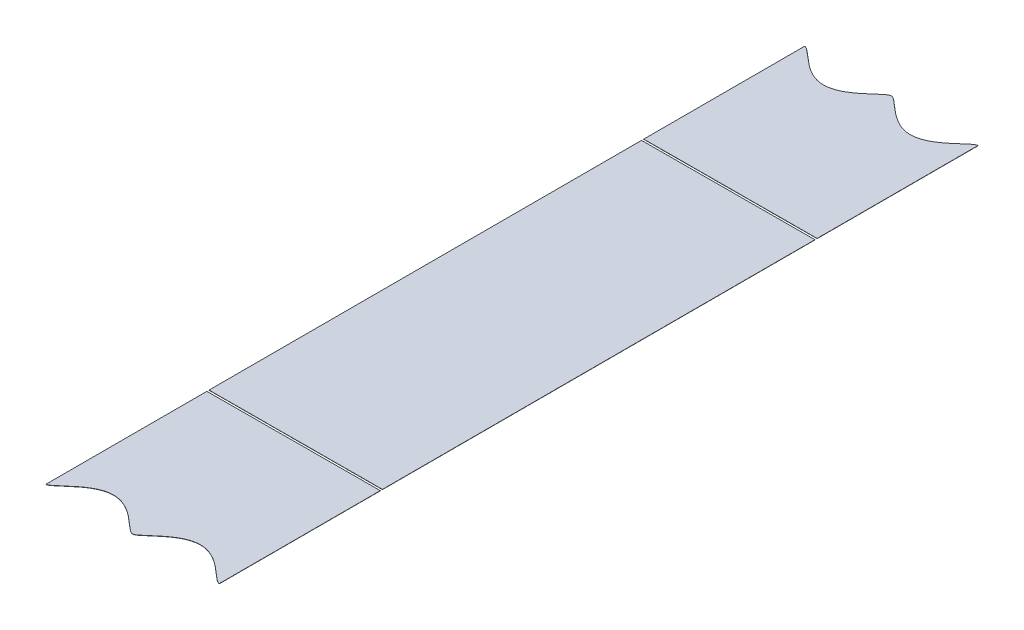
ISO-10303-21;
HEADER;
FILE_DESCRIPTION(('STEP AP214'),'2;1');
FILE_NAME('part.step','',(''),(''),'','','');
FILE_SCHEMA(('AUTOMOTIVE_DESIGN { 1 0 10303 214 1 1 1 1 }'));
ENDSEC;
DATA;
#1=APPLICATION_CONTEXT('core data for automotive mechanical design processes');
#2=APPLICATION_PROTOCOL_DEFINITION('international standard','automotive_design',2000,#1);
#3=PRODUCT_CONTEXT('',#1,'mechanical');
#4=PRODUCT('Part','Part','',(#3));
#5=PRODUCT_RELATED_PRODUCT_CATEGORY('part','',(#4));
#6=PRODUCT_DEFINITION_FORMATION('','',#4);
#7=PRODUCT_DEFINITION_CONTEXT('part definition',#1,'design');
#8=PRODUCT_DEFINITION('design','',#6,#7);
#9=PRODUCT_DEFINITION_SHAPE('','',#8);
#10=(LENGTH_UNIT() NAMED_UNIT(*) SI_UNIT(.MILLI.,.METRE.));
#11=(NAMED_UNIT(*) PLANE_ANGLE_UNIT() SI_UNIT($,.RADIAN.));
#12=(NAMED_UNIT(*) SI_UNIT($,.STERADIAN.) SOLID_ANGLE_UNIT());
#13=UNCERTAINTY_MEASURE_WITH_UNIT(LENGTH_MEASURE(1.E-05),#10,'distance_accuracy_value','');
#14=(GEOMETRIC_REPRESENTATION_CONTEXT(3) GLOBAL_UNCERTAINTY_ASSIGNED_CONTEXT((#13)) GLOBAL_UNIT_ASSIGNED_CONTEXT((#10,
#11,#12)) REPRESENTATION_CONTEXT('',''));
#15=CARTESIAN_POINT('',(0.,0.,0.));
#16=DIRECTION('',(0.,0.,1.));
#17=DIRECTION('',(1.,0.,0.));
#18=AXIS2_PLACEMENT_3D('',#15,#16,#17);
#19=CARTESIAN_POINT('',(-874.689831525036,342.352608319311,3690.50629715667));
#20=DIRECTION('',(0.00396825396824471,-0.999992126449225,0.));
#21=DIRECTION('',(0.999992126449225,0.00396825396824471,0.));
#22=AXIS2_PLACEMENT_3D('',#19,#20,#21);
#23=PLANE('',#22);
#24=DIRECTION('',(0.999992126449225,0.0039682539682445,0.));
#25=VECTOR('',#24,1.);
#26=CARTESIAN_POINT('',(2640.0503968254,356.300099994095,-100.));
#27=LINE('',#26,#25);
#28=CARTESIAN_POINT('',(2640.0503968254,356.300099994095,-100.));
#29=VERTEX_POINT('',#28);
#30=CARTESIAN_POINT('',(2719.43166885493,356.615107522058,-100.));
#31=VERTEX_POINT('',#30);
#32=EDGE_CURVE('E14',#29,#31,#27,.T.);
#33=ORIENTED_EDGE('',*,*,#32,.F.);
#34=DIRECTION('',(0.,0.,1.));
#35=VECTOR('',#34,1.);
#36=CARTESIAN_POINT('',(2640.0503968254,356.300099994095,-173.652216912017));
#37=LINE('',#36,#35);
#38=CARTESIAN_POINT('',(2640.0503968254,356.300099994095,-173.652216912019));
#39=VERTEX_POINT('',#38);
#40=EDGE_CURVE('E109',#39,#29,#37,.T.);
#41=ORIENTED_EDGE('',*,*,#40,.F.);
#42=CARTESIAN_POINT('',(2719.43166885493,356.615107522058,-173.652216912019));
#43=CARTESIAN_POINT('',(2719.25336327566,356.614399954664,-173.646625466255));
#44=CARTESIAN_POINT('',(2718.90207666095,356.613005949186,-173.559155637961));
#45=CARTESIAN_POINT('',(2718.43359748682,356.611146890207,-173.359222557986));
#46=CARTESIAN_POINT('',(2717.81798377242,356.608703959407,-172.958303623836));
#47=CARTESIAN_POINT('',(2717.23650187237,356.606396473382,-172.512932866644));
#48=CARTESIAN_POINT('',(2716.92336939028,356.605153874383,-172.25423628575));
#49=CARTESIAN_POINT('',(2716.49878369486,356.603468997247,-171.903461856444));
#50=CARTESIAN_POINT('',(2715.82331129543,356.600788530112,-171.313780667747));
#51=CARTESIAN_POINT('',(2715.62461925183,356.600000063414,-171.140324342141));
#52=CARTESIAN_POINT('',(2714.86651347999,356.59699168349,-170.474628822936));
#53=CARTESIAN_POINT('',(2714.74003292812,356.596489772586,-170.36379777106));
#54=CARTESIAN_POINT('',(2714.11511295219,356.594009911886,-169.816199446652));
#55=CARTESIAN_POINT('',(2713.65247367997,356.592174027304,-169.419143192877));
#56=CARTESIAN_POINT('',(2713.06635338962,356.589848134823,-168.916110396653));
#57=CARTESIAN_POINT('',(2712.54648640413,356.587785154351,-168.486605911843));
#58=CARTESIAN_POINT('',(2711.33413988219,356.582974217576,-167.484987646326));
#59=CARTESIAN_POINT('',(2710.25972872082,356.578710647652,-166.700784115182));
#60=CARTESIAN_POINT('',(2709.01244281554,356.573761061438,-165.790400784825));
#61=CARTESIAN_POINT('',(2707.84953556888,356.569146313807,-165.096938783266));
#62=CARTESIAN_POINT('',(2706.52889617694,356.563905640037,-164.309418335097));
#63=CARTESIAN_POINT('',(2705.26728183354,356.558899194493,-163.771345912409));
#64=CARTESIAN_POINT('',(2703.86588156271,356.553338038522,-163.173655466969));
#65=CARTESIAN_POINT('',(2701.05071637291,356.542166660128,-162.543732035845));
#66=CARTESIAN_POINT('',(2698.17465183204,356.530753615739,-162.543467999676));
#67=CARTESIAN_POINT('',(2695.35854398808,356.519578496624,-163.17304343693));
#68=CARTESIAN_POINT('',(2693.95591996837,356.514012484468,-163.771217133109));
#69=CARTESIAN_POINT('',(2692.69648697398,356.50901469514,-164.30832449671));
#70=CARTESIAN_POINT('',(2691.37808318925,356.503782892897,-165.094125503448));
#71=CARTESIAN_POINT('',(2690.21341726245,356.499161166321,-165.788294974438));
#72=CARTESIAN_POINT('',(2688.96398092241,356.494203046569,-166.700193067622));
#73=CARTESIAN_POINT('',(2687.89232926098,356.489950427128,-167.482335442792));
#74=CARTESIAN_POINT('',(2686.68353618388,356.485153591435,-168.480722104019));
#75=CARTESIAN_POINT('',(2686.16178178844,356.483083121183,-168.911658249093));
#76=CARTESIAN_POINT('',(2685.57330949206,356.480747895271,-169.416668701426));
#77=CARTESIAN_POINT('',(2685.11012917903,356.478909863684,-169.8141570808));
#78=CARTESIAN_POINT('',(2684.48467716416,356.476427891702,-170.362211520537));
#79=CARTESIAN_POINT('',(2684.35622944635,356.475918174523,-170.474764266942));
#80=CARTESIAN_POINT('',(2683.6012876088,356.472922349992,-171.137685809265));
#81=CARTESIAN_POINT('',(2683.40337901544,356.472136992248,-171.310471497709));
#82=CARTESIAN_POINT('',(2682.73157177862,356.469471069524,-171.896998206569));
#83=CARTESIAN_POINT('',(2682.30876813853,356.467793264091,-172.246601216163));
#84=CARTESIAN_POINT('',(2681.99827251613,356.466561128904,-172.503340264186));
#85=CARTESIAN_POINT('',(2681.41796337893,356.464258296736,-172.948918646703));
#86=CARTESIAN_POINT('',(2681.15134565763,356.463200281575,-173.123420981755));
#87=CARTESIAN_POINT('',(2680.79870151334,356.461800889032,-173.35422794507));
#88=CARTESIAN_POINT('',(2680.32703989949,356.459929201224,-173.557093339146));
#89=CARTESIAN_POINT('',(2679.97435392887,356.458529642702,-173.645974045404));
#90=CARTESIAN_POINT('',(2679.61413987556,356.457100210601,-173.658266805285));
#91=CARTESIAN_POINT('',(2679.25782551004,356.455686253574,-173.590254462723));
#92=CARTESIAN_POINT('',(2678.7814026428,356.453795671754,-173.408008229969));
#93=CARTESIAN_POINT('',(2678.15784559128,356.451321219528,-173.016019024524));
#94=CARTESIAN_POINT('',(2677.57062511323,356.448990961188,-172.572788154957));
#95=CARTESIAN_POINT('',(2677.25640774166,356.447744057039,-172.315051537981));
#96=CARTESIAN_POINT('',(2676.82714675771,356.446040627024,-171.962950464614));
#97=CARTESIAN_POINT('',(2676.15205769789,356.44336168109,-171.374479739641));
#98=CARTESIAN_POINT('',(2675.94296920409,356.442531958312,-171.192218664992));
#99=CARTESIAN_POINT('',(2675.60681877818,356.441198017548,-170.897112934053));
#100=CARTESIAN_POINT('',(2675.08593218089,356.439130990966,-170.439827718325));
#101=CARTESIAN_POINT('',(2675.06174809659,356.439035021622,-170.418623837761));
#102=CARTESIAN_POINT('',(2674.42349522226,356.436502252179,-169.859022839416));
#103=CARTESIAN_POINT('',(2673.96340352107,356.434676477085,-169.463600384942));
#104=CARTESIAN_POINT('',(2673.37331912765,356.432334853912,-168.956456659908));
#105=CARTESIAN_POINT('',(2672.85215201822,356.430266714178,-168.52505968445));
#106=CARTESIAN_POINT('',(2671.64203818338,356.425464637342,-167.523385866472));
#107=CARTESIAN_POINT('',(2670.57136706357,356.421215908969,-166.739150975074));
#108=CARTESIAN_POINT('',(2669.31849075808,356.416244138453,-165.821456180484));
#109=CARTESIAN_POINT('',(2668.15153565928,356.41161332779,-165.122537364466));
#110=CARTESIAN_POINT('',(2666.82938751404,356.406366666857,-164.330669522056));
#111=CARTESIAN_POINT('',(2665.56686320734,356.40135661032,-163.788639955249));
#112=CARTESIAN_POINT('',(2664.16795144573,356.395805329462,-163.18805624203));
#113=CARTESIAN_POINT('',(2661.35962227825,356.384661078354,-162.549920673153));
#114=CARTESIAN_POINT('',(2658.4845757787,356.373252073844,-162.537485124093));
#115=CARTESIAN_POINT('',(2655.66129286038,356.362048481988,-163.15841757952));
#116=CARTESIAN_POINT('',(2654.25472202303,356.356466807733,-163.754368461799));
#117=CARTESIAN_POINT('',(2652.98706519882,356.351436383903,-164.29146277853));
#118=CARTESIAN_POINT('',(2651.66002927199,356.346170326858,-165.080563690001));
#119=CARTESIAN_POINT('',(2650.4944291399,356.34154489309,-165.773669361108));
#120=CARTESIAN_POINT('',(2649.24433816958,356.336584175578,-166.684737604181));
#121=CARTESIAN_POINT('',(2648.16918346286,356.332317655054,-167.468312026312));
#122=CARTESIAN_POINT('',(2646.95680662685,356.327506597983,-168.469075959413));
#123=CARTESIAN_POINT('',(2646.43798629125,356.325447770917,-168.897339403747));
#124=CARTESIAN_POINT('',(2645.85404413414,356.32313052189,-169.398164427017));
#125=CARTESIAN_POINT('',(2645.38778806165,356.321280284812,-169.798054562563));
#126=CARTESIAN_POINT('',(2644.76224529839,356.318797952715,-170.346087909561));
#127=CARTESIAN_POINT('',(2644.62080596261,356.31823668109,-170.470001856191));
#128=CARTESIAN_POINT('',(2643.86605824614,356.315241626887,-171.132773576622));
#129=CARTESIAN_POINT('',(2643.66800970221,356.314455713779,-171.305700111455));
#130=CARTESIAN_POINT('',(2642.98670531965,356.311752103673,-171.900582576675));
#131=CARTESIAN_POINT('',(2642.56017708301,356.310059517978,-172.253012829818));
#132=CARTESIAN_POINT('',(2642.2466477609,356.308815344206,-172.51207473679));
#133=CARTESIAN_POINT('',(2641.6640271652,356.306503339511,-172.958380970878));
#134=CARTESIAN_POINT('',(2641.04766174761,356.304057425739,-173.359693013486));
#135=CARTESIAN_POINT('',(2640.57956567511,356.302199887016,-173.559257747345));
#136=CARTESIAN_POINT('',(2640.22871871028,356.300807626194,-173.64662505233));
#137=CARTESIAN_POINT('',(2640.0503968254,356.300099994095,-173.652216912019));
#138=B_SPLINE_CURVE_WITH_KNOTS('',2,(#42,#43,#44,#45,#46,#47,#48,#49,#50,#51,#52,#53,#54,#55,
#56,#57,#58,#59,#60,#61,#62,#63,#64,#65,#66,#67,#68,#69,#70,#71,#72,#73,#74,#75,#76,#77,#78,#79,
#80,#81,#82,#83,#84,#85,#86,#87,#88,#89,#90,#91,#92,#93,#94,#95,#96,#97,#98,#99,#100,#101,#102,
#103,#104,#105,#106,#107,#108,#109,#110,#111,#112,#113,#114,#115,#116,#117,#118,#119,#120,#121,
#122,#123,#124,#125,#126,#127,#128,#129,#130,#131,#132,#133,#134,#135,#136,#137),.UNSPECIFIED.,
.F.,.F.,(3,1,1,1,1,2,2,1,2,2,2,2,2,2,1,1,1,2,2,2,2,2,2,1,2,2,1,2,1,1,1,1,1,1,1,2,2,2,2,2,2,2,2,
2,1,1,1,2,2,2,2,2,2,1,2,2,1,1,1,1,3),(0.,0.00390625,0.0078125,0.015625,0.0234375,0.03125,
0.046875,0.0546875,0.0625,0.078125,0.09375,0.125,0.15625,0.1875,0.21875,0.25,0.28125,0.3125,
0.34375,0.375,0.40625,0.421875,0.4375,0.4453125,0.453125,0.46875,0.4765625,0.484375,0.4921875,
0.49609375,0.5,0.50390625,0.5078125,0.515625,0.5234375,0.53125,0.546875,0.5546875,0.5625,
0.578125,0.59375,0.625,0.65625,0.6875,0.71875,0.75,0.78125,0.8125,0.84375,0.875,0.90625,
0.921875,0.9375,0.9453125,0.953125,0.96875,0.9765625,0.984375,0.9921875,0.99609375,1.),.UNSPECIFIED.);
#139=CARTESIAN_POINT('',(2719.43166885493,356.615107522058,-173.652216912019));
#140=VERTEX_POINT('',#139);
#141=EDGE_CURVE('E105',#140,#39,#138,.T.);
#142=ORIENTED_EDGE('',*,*,#141,.F.);
#143=DIRECTION('',(0.,0.,1.));
#144=VECTOR('',#143,1.);
#145=CARTESIAN_POINT('',(2719.43166885493,356.615107522058,-173.652216912017));
#146=LINE('',#145,#144);
#147=EDGE_CURVE('E98',#140,#31,#146,.T.);
#148=ORIENTED_EDGE('',*,*,#147,.T.);
#149=EDGE_LOOP('',(#33,#41,#142,#148));
#150=FACE_BOUND('',#149,.T.);
#151=ADVANCED_FACE('F52',(#150),#23,.T.);
#152=CARTESIAN_POINT('',(-874.690228350433,342.452607531956,3690.50629715667));
#153=DIRECTION('',(0.00396825396824471,-0.999992126449225,0.));
#154=DIRECTION('',(0.999992126449225,0.00396825396824471,0.));
#155=AXIS2_PLACEMENT_3D('',#152,#153,#154);
#156=PLANE('',#155);
#157=DIRECTION('',(0.,0.,1.));
#158=VECTOR('',#157,1.);
#159=CARTESIAN_POINT('',(2640.05,356.40009920674,-173.652216912017));
#160=LINE('',#159,#158);
#161=CARTESIAN_POINT('',(2640.05,356.40009920674,-173.652216912019));
#162=VERTEX_POINT('',#161);
#163=CARTESIAN_POINT('',(2640.05,356.40009920674,-100.));
#164=VERTEX_POINT('',#163);
#165=EDGE_CURVE('E55',#162,#164,#160,.T.);
#166=ORIENTED_EDGE('',*,*,#165,.T.);
#167=DIRECTION('',(0.999992126449225,0.00396825396824471,0.));
#168=VECTOR('',#167,1.);
#169=CARTESIAN_POINT('',(-874.690228350433,342.452607531955,-100.));
#170=LINE('',#169,#168);
#171=CARTESIAN_POINT('',(2719.43127202954,356.715106734703,-100.));
#172=VERTEX_POINT('',#171);
#173=EDGE_CURVE('E70',#164,#172,#170,.T.);
#174=ORIENTED_EDGE('',*,*,#173,.T.);
#175=DIRECTION('',(0.,0.,1.));
#176=VECTOR('',#175,1.);
#177=CARTESIAN_POINT('',(2719.43127202953,356.715106734703,-173.652216912017));
#178=LINE('',#177,#176);
#179=CARTESIAN_POINT('',(2719.43127202953,356.715106734703,-173.652216912019));
#180=VERTEX_POINT('',#179);
#181=EDGE_CURVE('E101',#180,#172,#178,.T.);
#182=ORIENTED_EDGE('',*,*,#181,.F.);
#183=CARTESIAN_POINT('',(2719.43127202954,356.715106734703,-173.652216912019));
#184=CARTESIAN_POINT('',(2719.25296645026,356.714399167309,-173.646625466255));
#185=CARTESIAN_POINT('',(2718.90167983555,356.713005161831,-173.559155637961));
#186=CARTESIAN_POINT('',(2718.43320066142,356.711146102852,-173.359222557986));
#187=CARTESIAN_POINT('',(2717.81758694703,356.708703172052,-172.958303623836));
#188=CARTESIAN_POINT('',(2717.23610504697,356.706395686026,-172.512932866644));
#189=CARTESIAN_POINT('',(2716.92297256488,356.705153087028,-172.25423628575));
#190=CARTESIAN_POINT('',(2716.49838686946,356.703468209892,-171.903461856444));
#191=CARTESIAN_POINT('',(2715.82291447003,356.700787742757,-171.313780667747));
#192=CARTESIAN_POINT('',(2715.62422242643,356.699999276059,-171.140324342141));
#193=CARTESIAN_POINT('',(2714.86611665459,356.696990896135,-170.474628822936));
#194=CARTESIAN_POINT('',(2714.73963610273,356.696488985231,-170.36379777106));
#195=CARTESIAN_POINT('',(2714.11471612679,356.694009124531,-169.816199446652));
#196=CARTESIAN_POINT('',(2713.65207685457,356.692173239949,-169.419143192877));
#197=CARTESIAN_POINT('',(2713.06595656423,356.689847347467,-168.916110396653));
#198=CARTESIAN_POINT('',(2712.54608957873,356.687784366996,-168.486605911843));
#199=CARTESIAN_POINT('',(2711.3337430568,356.682973430221,-167.484987646326));
#200=CARTESIAN_POINT('',(2710.25933189542,356.678709860297,-166.700784115182));
#201=CARTESIAN_POINT('',(2709.01204599015,356.673760274083,-165.790400784825));
#202=CARTESIAN_POINT('',(2707.84913874348,356.669145526452,-165.096938783266));
#203=CARTESIAN_POINT('',(2706.52849935154,356.663904852682,-164.309418335097));
#204=CARTESIAN_POINT('',(2705.26688500814,356.658898407138,-163.771345912409));
#205=CARTESIAN_POINT('',(2703.86548473731,356.653337251167,-163.173655466969));
#206=CARTESIAN_POINT('',(2701.05031954752,356.642165872772,-162.543732035845));
#207=CARTESIAN_POINT('',(2698.17425500665,356.630752828384,-162.543467999676));
#208=CARTESIAN_POINT('',(2695.35814716268,356.619577709269,-163.17304343693));
#209=CARTESIAN_POINT('',(2693.95552314298,356.614011697113,-163.771217133109));
#210=CARTESIAN_POINT('',(2692.69609014859,356.609013907785,-164.30832449671));
#211=CARTESIAN_POINT('',(2691.37768636385,356.603782105541,-165.094125503448));
#212=CARTESIAN_POINT('',(2690.21302043705,356.599160378966,-165.788294974438));
#213=CARTESIAN_POINT('',(2688.96358409702,356.594202259214,-166.700193067622));
#214=CARTESIAN_POINT('',(2687.89193243558,356.589949639773,-167.482335442792));
#215=CARTESIAN_POINT('',(2686.68313935848,356.58515280408,-168.480722104019));
#216=CARTESIAN_POINT('',(2686.16138496304,356.583082333827,-168.911658249093));
#217=CARTESIAN_POINT('',(2685.57291266666,356.580747107916,-169.416668701426));
#218=CARTESIAN_POINT('',(2685.10973235363,356.578909076329,-169.8141570808));
#219=CARTESIAN_POINT('',(2684.48428033876,356.576427104347,-170.362211520537));
#220=CARTESIAN_POINT('',(2684.35583262095,356.575917387167,-170.474764266942));
#221=CARTESIAN_POINT('',(2683.6008907834,356.572921562637,-171.137685809265));
#222=CARTESIAN_POINT('',(2683.40298219004,356.572136204893,-171.310471497709));
#223=CARTESIAN_POINT('',(2682.73117495322,356.569470282169,-171.896998206569));
#224=CARTESIAN_POINT('',(2682.30837131314,356.567792476736,-172.246601216163));
#225=CARTESIAN_POINT('',(2681.99787569074,356.566560341549,-172.503340264186));
#226=CARTESIAN_POINT('',(2681.41756655353,356.564257509381,-172.948918646703));
#227=CARTESIAN_POINT('',(2681.15094883223,356.56319949422,-173.123420981755));
#228=CARTESIAN_POINT('',(2680.79830468794,356.561800101677,-173.35422794507));
#229=CARTESIAN_POINT('',(2680.32664307409,356.559928413869,-173.557093339146));
#230=CARTESIAN_POINT('',(2679.97395710347,356.558528855347,-173.645974045404));
#231=CARTESIAN_POINT('',(2679.61374305016,356.557099423246,-173.658266805285));
#232=CARTESIAN_POINT('',(2679.25742868464,356.555685466218,-173.590254462723));
#233=CARTESIAN_POINT('',(2678.7810058174,356.553794884399,-173.408008229969));
#234=CARTESIAN_POINT('',(2678.15744876588,356.551320432173,-173.016019024524));
#235=CARTESIAN_POINT('',(2677.57022828783,356.548990173833,-172.572788154957));
#236=CARTESIAN_POINT('',(2677.25601091626,356.547743269684,-172.315051537981));
#237=CARTESIAN_POINT('',(2676.82674993232,356.546039839669,-171.962950464614));
#238=CARTESIAN_POINT('',(2676.15166087249,356.543360893735,-171.374479739641));
#239=CARTESIAN_POINT('',(2675.9425723787,356.542531170957,-171.192218664992));
#240=CARTESIAN_POINT('',(2675.60642195278,356.541197230193,-170.897112934053));
#241=CARTESIAN_POINT('',(2675.08553535549,356.539130203611,-170.439827718325));
#242=CARTESIAN_POINT('',(2675.06135127119,356.539034234267,-170.418623837761));
#243=CARTESIAN_POINT('',(2674.42309839686,356.536501464824,-169.859022839416));
#244=CARTESIAN_POINT('',(2673.96300669568,356.53467568973,-169.463600384942));
#245=CARTESIAN_POINT('',(2673.37292230225,356.532334066557,-168.956456659908));
#246=CARTESIAN_POINT('',(2672.85175519282,356.530265926823,-168.52505968445));
#247=CARTESIAN_POINT('',(2671.64164135798,356.525463849987,-167.523385866472));
#248=CARTESIAN_POINT('',(2670.57097023817,356.521215121614,-166.739150975074));
#249=CARTESIAN_POINT('',(2669.31809393268,356.516243351098,-165.821456180484));
#250=CARTESIAN_POINT('',(2668.15113883388,356.511612540435,-165.122537364466));
#251=CARTESIAN_POINT('',(2666.82899068864,356.506365879501,-164.330669522056));
#252=CARTESIAN_POINT('',(2665.56646638194,356.501355822965,-163.788639955249));
#253=CARTESIAN_POINT('',(2664.16755462034,356.495804542107,-163.18805624203));
#254=CARTESIAN_POINT('',(2661.35922545285,356.484660290999,-162.549920673153));
#255=CARTESIAN_POINT('',(2658.4841789533,356.473251286489,-162.537485124093));
#256=CARTESIAN_POINT('',(2655.66089603498,356.462047694633,-163.15841757952));
#257=CARTESIAN_POINT('',(2654.25432519764,356.456466020378,-163.754368461799));
#258=CARTESIAN_POINT('',(2652.98666837342,356.451435596548,-164.29146277853));
#259=CARTESIAN_POINT('',(2651.65963244659,356.446169539503,-165.080563690001));
#260=CARTESIAN_POINT('',(2650.4940323145,356.441544105735,-165.773669361108));
#261=CARTESIAN_POINT('',(2649.24394134418,356.436583388223,-166.684737604181));
#262=CARTESIAN_POINT('',(2648.16878663747,356.432316867698,-167.468312026312));
#263=CARTESIAN_POINT('',(2646.95640980145,356.427505810628,-168.469075959413));
#264=CARTESIAN_POINT('',(2646.43758946586,356.425446983562,-168.897339403747));
#265=CARTESIAN_POINT('',(2645.85364730874,356.423129734535,-169.398164427017));
#266=CARTESIAN_POINT('',(2645.38739123625,356.421279497457,-169.798054562563));
#267=CARTESIAN_POINT('',(2644.76184847299,356.41879716536,-170.346087909561));
#268=CARTESIAN_POINT('',(2644.62040913722,356.418235893735,-170.470001856191));
#269=CARTESIAN_POINT('',(2643.86566142074,356.415240839532,-171.132773576622));
#270=CARTESIAN_POINT('',(2643.66761287682,356.414454926424,-171.305700111455));
#271=CARTESIAN_POINT('',(2642.98630849425,356.411751316317,-171.900582576675));
#272=CARTESIAN_POINT('',(2642.55978025762,356.410058730623,-172.253012829818));
#273=CARTESIAN_POINT('',(2642.2462509355,356.40881455685,-172.51207473679));
#274=CARTESIAN_POINT('',(2641.6636303398,356.406502552156,-172.958380970878));
#275=CARTESIAN_POINT('',(2641.04726492221,356.404056638384,-173.359693013486));
#276=CARTESIAN_POINT('',(2640.57916884971,356.402199099661,-173.559257747345));
#277=CARTESIAN_POINT('',(2640.22832188488,356.400806838838,-173.64662505233));
#278=CARTESIAN_POINT('',(2640.05,356.40009920674,-173.652216912019));
#279=B_SPLINE_CURVE_WITH_KNOTS('',2,(#183,#184,#185,#186,#187,#188,#189,#190,#191,#192,#193,
#194,#195,#196,#197,#198,#199,#200,#201,#202,#203,#204,#205,#206,#207,#208,#209,#210,#211,#212,
#213,#214,#215,#216,#217,#218,#219,#220,#221,#222,#223,#224,#225,#226,#227,#228,#229,#230,#231,
#232,#233,#234,#235,#236,#237,#238,#239,#240,#241,#242,#243,#244,#245,#246,#247,#248,#249,#250,
#251,#252,#253,#254,#255,#256,#257,#258,#259,#260,#261,#262,#263,#264,#265,#266,#267,#268,#269,
#270,#271,#272,#273,#274,#275,#276,#277,#278),.UNSPECIFIED.,.F.,.F.,(3,1,1,1,1,2,2,1,2,2,2,2,2,
2,1,1,1,2,2,2,2,2,2,1,2,2,1,2,1,1,1,1,1,1,1,2,2,2,2,2,2,2,2,2,1,1,1,2,2,2,2,2,2,1,2,2,1,1,1,1,
3),(0.,0.00390625,0.0078125,0.015625,0.0234375,0.03125,0.046875,0.0546875,0.0625,0.078125,
0.09375,0.125,0.15625,0.1875,0.21875,0.25,0.28125,0.3125,0.34375,0.375,0.40625,0.421875,0.4375,
0.4453125,0.453125,0.46875,0.4765625,0.484375,0.4921875,0.49609375,0.5,0.50390625,0.5078125,
0.515625,0.5234375,0.53125,0.546875,0.5546875,0.5625,0.578125,0.59375,0.625,0.65625,0.6875,
0.71875,0.75,0.78125,0.8125,0.84375,0.875,0.90625,0.921875,0.9375,0.9453125,0.953125,0.96875,
0.9765625,0.984375,0.9921875,0.99609375,1.),.UNSPECIFIED.);
#280=EDGE_CURVE('E110',#180,#162,#279,.T.);
#281=ORIENTED_EDGE('',*,*,#280,.T.);
#282=EDGE_LOOP('',(#166,#174,#182,#281));
#283=FACE_BOUND('',#282,.T.);
#284=ADVANCED_FACE('F143',(#283),#156,.F.);
#285=CARTESIAN_POINT('',(2719.43166885493,356.615107522058,-173.652216912017));
#286=DIRECTION('',(-0.999992126449225,-0.00396825396824472,0.));
#287=DIRECTION('',(0.00396825396824472,-0.999992126449225,0.));
#288=AXIS2_PLACEMENT_3D('',#285,#286,#287);
#289=PLANE('',#288);
#290=ORIENTED_EDGE('',*,*,#181,.T.);
#291=DIRECTION('',(0.00396825396824471,-0.999992126449225,0.));
#292=VECTOR('',#291,1.);
#293=CARTESIAN_POINT('',(2719.39198631525,366.61502878655,-100.));
#294=LINE('',#293,#292);
#295=EDGE_CURVE('E89',#172,#31,#294,.T.);
#296=ORIENTED_EDGE('',*,*,#295,.T.);
#297=ORIENTED_EDGE('',*,*,#147,.F.);
#298=DIRECTION('',(-0.00396825396824472,0.999992126449225,0.));
#299=VECTOR('',#298,1.);
#300=CARTESIAN_POINT('',(2719.43166885493,356.615107522058,-173.652216912019));
#301=LINE('',#300,#299);
#302=EDGE_CURVE('E102',#140,#180,#301,.T.);
#303=ORIENTED_EDGE('',*,*,#302,.T.);
#304=EDGE_LOOP('',(#290,#296,#297,#303));
#305=FACE_BOUND('',#304,.T.);
#306=ADVANCED_FACE('F97',(#305),#289,.F.);
#307=CARTESIAN_POINT('',(2640.0503968254,356.300099994095,-173.652216912017));
#308=DIRECTION('',(-0.999992126449225,-0.00396825396824472,0.));
#309=DIRECTION('',(0.00396825396824472,-0.999992126449225,0.));
#310=AXIS2_PLACEMENT_3D('',#307,#308,#309);
#311=PLANE('',#310);
#312=DIRECTION('',(0.00396825396824472,-0.999992126449225,0.));
#313=VECTOR('',#312,1.);
#314=CARTESIAN_POINT('',(2640.0503968254,356.300099994095,-100.));
#315=LINE('',#314,#313);
#316=EDGE_CURVE('E61',#164,#29,#315,.T.);
#317=ORIENTED_EDGE('',*,*,#316,.F.);
#318=ORIENTED_EDGE('',*,*,#165,.F.);
#319=DIRECTION('',(-0.00396825396824472,0.999992126449225,0.));
#320=VECTOR('',#319,1.);
#321=CARTESIAN_POINT('',(2640.0503968254,356.300099994095,-173.652216912019));
#322=LINE('',#321,#320);
#323=EDGE_CURVE('E127',#39,#162,#322,.T.);
#324=ORIENTED_EDGE('',*,*,#323,.F.);
#325=ORIENTED_EDGE('',*,*,#40,.T.);
#326=EDGE_LOOP('',(#317,#318,#324,#325));
#327=FACE_BOUND('',#326,.T.);
#328=ADVANCED_FACE('F135',(#327),#311,.T.);
#329=DIRECTION('',(-0.00396825396824472,0.999992126449225,0.));
#330=VECTOR('',#329,1.);
#331=SURFACE_OF_LINEAR_EXTRUSION('',#138,#330);
#332=ORIENTED_EDGE('',*,*,#280,.F.);
#333=ORIENTED_EDGE('',*,*,#302,.F.);
#334=ORIENTED_EDGE('',*,*,#141,.T.);
#335=ORIENTED_EDGE('',*,*,#323,.T.);
#336=EDGE_LOOP('',(#332,#333,#334,#335));
#337=FACE_BOUND('',#336,.T.);
#338=ADVANCED_FACE('F132',(#337),#331,.T.);
#339=CARTESIAN_POINT('',(2640.01071428572,366.300021258587,-100.));
#340=DIRECTION('',(0.,0.,-1.));
#341=DIRECTION('',(0.,1.,0.));
#342=AXIS2_PLACEMENT_3D('',#339,#340,#341);
#343=PLANE('',#342);
#344=ORIENTED_EDGE('',*,*,#316,.T.);
#345=ORIENTED_EDGE('',*,*,#32,.T.);
#346=ORIENTED_EDGE('',*,*,#295,.F.);
#347=ORIENTED_EDGE('',*,*,#173,.F.);
#348=EDGE_LOOP('',(#344,#345,#346,#347));
#349=FACE_BOUND('',#348,.T.);
#350=ADVANCED_FACE('F88',(#349),#343,.F.);
#351=CLOSED_SHELL('',(#151,#284,#306,#328,#338,#350));
#352=MANIFOLD_SOLID_BREP('B2',#351);
#353=CARTESIAN_POINT('',(2640.0503968254,356.300099994095,-173.652216912017));
#354=DIRECTION('',(-0.999992126449225,-0.00396825396824472,0.));
#355=DIRECTION('',(0.00396825396824472,-0.999992126449225,0.));
#356=AXIS2_PLACEMENT_3D('',#353,#354,#355);
#357=PLANE('',#356);
#358=DIRECTION('',(0.00396825396824471,-0.999992126449225,0.));
#359=VECTOR('',#358,1.);
#360=CARTESIAN_POINT('',(2640.01071428572,366.300021258587,99.9999999999999));
#361=LINE('',#360,#359);
#362=CARTESIAN_POINT('',(2640.05,356.40009920674,100.));
#363=VERTEX_POINT('',#362);
#364=CARTESIAN_POINT('',(2640.0503968254,356.300099994095,99.9999999999999));
#365=VERTEX_POINT('',#364);
#366=EDGE_CURVE('E249',#363,#365,#361,.T.);
#367=ORIENTED_EDGE('',*,*,#366,.T.);
#368=DIRECTION('',(0.,0.,1.));
#369=VECTOR('',#368,1.);
#370=CARTESIAN_POINT('',(2640.0503968254,356.300099994095,-173.652216912017));
#371=LINE('',#370,#369);
#372=CARTESIAN_POINT('',(2640.0503968254,356.300099994095,173.652216912016));
#373=VERTEX_POINT('',#372);
#374=EDGE_CURVE('E244',#365,#373,#371,.T.);
#375=ORIENTED_EDGE('',*,*,#374,.T.);
#376=DIRECTION('',(-0.00396825396824472,0.999992126449225,0.));
#377=VECTOR('',#376,1.);
#378=CARTESIAN_POINT('',(2640.0503968254,356.300099994095,173.652216912016));
#379=LINE('',#378,#377);
#380=CARTESIAN_POINT('',(2640.05,356.40009920674,173.652216912016));
#381=VERTEX_POINT('',#380);
#382=EDGE_CURVE('E247',#373,#381,#379,.T.);
#383=ORIENTED_EDGE('',*,*,#382,.T.);
#384=DIRECTION('',(0.,0.,1.));
#385=VECTOR('',#384,1.);
#386=CARTESIAN_POINT('',(2640.05,356.40009920674,-173.652216912017));
#387=LINE('',#386,#385);
#388=EDGE_CURVE('E205',#363,#381,#387,.T.);
#389=ORIENTED_EDGE('',*,*,#388,.F.);
#390=EDGE_LOOP('',(#367,#375,#383,#389));
#391=FACE_BOUND('',#390,.T.);
#392=ADVANCED_FACE('F202',(#391),#357,.T.);
#393=CARTESIAN_POINT('',(2719.43166885493,356.615107522058,-173.652216912017));
#394=DIRECTION('',(-0.999992126449225,-0.00396825396824472,0.));
#395=DIRECTION('',(0.00396825396824472,-0.999992126449225,0.));
#396=AXIS2_PLACEMENT_3D('',#393,#394,#395);
#397=PLANE('',#396);
#398=DIRECTION('',(0.,0.,1.));
#399=VECTOR('',#398,1.);
#400=CARTESIAN_POINT('',(2719.43166885493,356.615107522058,-173.652216912017));
#401=LINE('',#400,#399);
#402=CARTESIAN_POINT('',(2719.43166885493,356.615107522058,99.9999999999999));
#403=VERTEX_POINT('',#402);
#404=CARTESIAN_POINT('',(2719.43166885493,356.615107522058,173.652216912016));
#405=VERTEX_POINT('',#404);
#406=EDGE_CURVE('E256',#403,#405,#401,.T.);
#407=ORIENTED_EDGE('',*,*,#406,.F.);
#408=DIRECTION('',(0.00396825396824471,-0.999992126449225,0.));
#409=VECTOR('',#408,1.);
#410=CARTESIAN_POINT('',(2719.39198631525,366.61502878655,99.9999999999999));
#411=LINE('',#410,#409);
#412=CARTESIAN_POINT('',(2719.43127202954,356.715106734703,99.9999999999999));
#413=VERTEX_POINT('',#412);
#414=EDGE_CURVE('E211',#413,#403,#411,.T.);
#415=ORIENTED_EDGE('',*,*,#414,.F.);
#416=DIRECTION('',(0.,0.,1.));
#417=VECTOR('',#416,1.);
#418=CARTESIAN_POINT('',(2719.43127202953,356.715106734703,-173.652216912017));
#419=LINE('',#418,#417);
#420=CARTESIAN_POINT('',(2719.43127202953,356.715106734703,173.652216912016));
#421=VERTEX_POINT('',#420);
#422=EDGE_CURVE('E263',#413,#421,#419,.T.);
#423=ORIENTED_EDGE('',*,*,#422,.T.);
#424=DIRECTION('',(-0.00396825396824472,0.999992126449225,0.));
#425=VECTOR('',#424,1.);
#426=CARTESIAN_POINT('',(2719.43166885493,356.615107522058,173.652216912016));
#427=LINE('',#426,#425);
#428=EDGE_CURVE('E267',#405,#421,#427,.T.);
#429=ORIENTED_EDGE('',*,*,#428,.F.);
#430=EDGE_LOOP('',(#407,#415,#423,#429));
#431=FACE_BOUND('',#430,.T.);
#432=ADVANCED_FACE('F291',(#431),#397,.F.);
#433=CARTESIAN_POINT('',(-874.689831525036,342.352608319311,3690.50629715667));
#434=DIRECTION('',(0.00396825396824471,-0.999992126449225,0.));
#435=DIRECTION('',(0.999992126449225,0.00396825396824471,0.));
#436=AXIS2_PLACEMENT_3D('',#433,#434,#435);
#437=PLANE('',#436);
#438=DIRECTION('',(-0.999992126449225,-0.0039682539682452,0.));
#439=VECTOR('',#438,1.);
#440=CARTESIAN_POINT('',(2640.0503968254,356.300099994095,99.9999999999999));
#441=LINE('',#440,#439);
#442=EDGE_CURVE('E50',#403,#365,#441,.T.);
#443=ORIENTED_EDGE('',*,*,#442,.F.);
#444=ORIENTED_EDGE('',*,*,#406,.T.);
#445=CARTESIAN_POINT('',(2719.43166885493,356.615107522058,173.652216912016));
#446=CARTESIAN_POINT('',(2719.25339221859,356.614400069518,173.6466377403));
#447=CARTESIAN_POINT('',(2718.90202927773,356.613005761156,173.559139239466));
#448=CARTESIAN_POINT('',(2718.43355329972,356.61114671486,173.359197549312));
#449=CARTESIAN_POINT('',(2717.81794281418,356.608703796873,172.958274078183));
#450=CARTESIAN_POINT('',(2717.2364626528,356.606396317747,172.512901391382));
#451=CARTESIAN_POINT('',(2716.92336939028,356.605153874383,172.254236285747));
#452=CARTESIAN_POINT('',(2716.49874743775,356.603468853368,171.903430646177));
#453=CARTESIAN_POINT('',(2715.82331129543,356.600788530112,171.313780667743));
#454=CARTESIAN_POINT('',(2715.62458786993,356.599999938882,171.140296816028));
#455=CARTESIAN_POINT('',(2714.86651174337,356.596991676598,170.474627261226));
#456=CARTESIAN_POINT('',(2714.74003292812,356.596489772586,170.363797771057));
#457=CARTESIAN_POINT('',(2714.1150792436,356.594009778121,169.816170106281));
#458=CARTESIAN_POINT('',(2713.65247367997,356.592174027304,169.419143192873));
#459=CARTESIAN_POINT('',(2713.06631603061,356.589847986571,168.916078853418));
#460=CARTESIAN_POINT('',(2712.54648640413,356.587785154352,168.486605911839));
#461=CARTESIAN_POINT('',(2711.33410139075,356.582974064831,167.484957426463));
#462=CARTESIAN_POINT('',(2710.25972872082,356.578710647652,166.700784115178));
#463=CARTESIAN_POINT('',(2709.01240141054,356.573760897131,165.790373031077));
#464=CARTESIAN_POINT('',(2707.84953556888,356.569146313807,165.096938783263));
#465=CARTESIAN_POINT('',(2706.52885181203,356.563905463984,164.309395358453));
#466=CARTESIAN_POINT('',(2705.26728183354,356.558899194494,163.771345912406));
#467=CARTESIAN_POINT('',(2703.86583445527,356.553337851586,163.173639880716));
#468=CARTESIAN_POINT('',(2701.05066734487,356.54216646557,162.543726434606));
#469=CARTESIAN_POINT('',(2698.17460273158,356.530753420895,162.543473591433));
#470=CARTESIAN_POINT('',(2695.35849677718,356.519578309278,163.17305905645));
#471=CARTESIAN_POINT('',(2693.95591996837,356.514012484468,163.771217133105));
#472=CARTESIAN_POINT('',(2692.69644260337,356.509014519065,164.308347473144));
#473=CARTESIAN_POINT('',(2691.37808318925,356.503782892897,165.094125503444));
#474=CARTESIAN_POINT('',(2690.21337589919,356.49916100218,165.78832269312));
#475=CARTESIAN_POINT('',(2688.96398092241,356.494203046569,166.700193067618));
#476=CARTESIAN_POINT('',(2687.89229062663,356.489950273816,167.482365758825));
#477=CARTESIAN_POINT('',(2686.68353618388,356.485153591435,168.480722104015));
#478=CARTESIAN_POINT('',(2686.16174421639,356.483082972086,168.911689969107));
#479=CARTESIAN_POINT('',(2685.57330949206,356.480747895271,169.416668701423));
#480=CARTESIAN_POINT('',(2685.11009538982,356.478909729599,169.814186489662));
#481=CARTESIAN_POINT('',(2684.48467716416,356.476427891702,170.362211520534));
#482=CARTESIAN_POINT('',(2684.35622539552,356.475918158448,170.474767857375));
#483=CARTESIAN_POINT('',(2683.60125677131,356.47292222762,171.137712860189));
#484=CARTESIAN_POINT('',(2683.40337901544,356.472136992248,171.310471497706));
#485=CARTESIAN_POINT('',(2682.73153574773,356.469470926543,171.897029228989));
#486=CARTESIAN_POINT('',(2682.30876813853,356.467793264091,172.246601216159));
#487=CARTESIAN_POINT('',(2681.99823355665,356.466560974302,172.503371575366));
#488=CARTESIAN_POINT('',(2681.41792226297,356.464258133576,172.948948425726));
#489=CARTESIAN_POINT('',(2681.15134565763,356.463200281575,173.123420981751));
#490=CARTESIAN_POINT('',(2680.79865722332,356.461800713277,173.354253137992));
#491=CARTESIAN_POINT('',(2680.32699238938,356.459929012691,173.557109958301));
#492=CARTESIAN_POINT('',(2679.97430447642,356.458529446461,173.645981404541));
#493=CARTESIAN_POINT('',(2679.61409022733,356.457100013583,173.658262730941));
#494=CARTESIAN_POINT('',(2679.25777744469,356.455686062837,173.59024028737));
#495=CARTESIAN_POINT('',(2678.78135795743,356.45379549443,173.407984348114));
#496=CARTESIAN_POINT('',(2678.15780414434,356.451321055054,173.015989759991));
#497=CARTESIAN_POINT('',(2677.57058564175,356.448990804554,172.572756789843));
#498=CARTESIAN_POINT('',(2677.25640774166,356.447744057039,172.315051537977));
#499=CARTESIAN_POINT('',(2676.82711011159,356.446040481602,171.962919023722));
#500=CARTESIAN_POINT('',(2676.15205769789,356.44336168109,171.374479739637));
#501=CARTESIAN_POINT('',(2675.94293597077,356.442531826433,171.192189539803));
#502=CARTESIAN_POINT('',(2675.60681877818,356.441198017548,170.897112934049));
#503=CARTESIAN_POINT('',(2675.08599522552,356.439131241146,170.439882987157));
#504=CARTESIAN_POINT('',(2675.06174809659,356.439035021622,170.418623837758));
#505=CARTESIAN_POINT('',(2674.42346169464,356.436502119132,169.8589936225));
#506=CARTESIAN_POINT('',(2673.96340352107,356.434676477085,169.463600384938));
#507=CARTESIAN_POINT('',(2673.37328159998,356.432334704992,168.95642492248));
#508=CARTESIAN_POINT('',(2672.85215201822,356.430266714178,168.525059684447));
#509=CARTESIAN_POINT('',(2671.64199951385,356.42546448389,167.52335542247));
#510=CARTESIAN_POINT('',(2670.57136706356,356.421215908969,166.73915097507));
#511=CARTESIAN_POINT('',(2669.31844945665,356.416243974557,165.821428409028));
#512=CARTESIAN_POINT('',(2668.15153565928,356.41161332779,165.122537364462));
#513=CARTESIAN_POINT('',(2666.82934321269,356.406366491056,164.330646427709));
#514=CARTESIAN_POINT('',(2665.56686320734,356.40135661032,163.788639955246));
#515=CARTESIAN_POINT('',(2664.16790390816,356.39580514082,163.188040348396));
#516=CARTESIAN_POINT('',(2661.35957284204,356.384660882177,162.549914854075));
#517=CARTESIAN_POINT('',(2658.48452651179,356.373251878339,162.53749054661));
#518=CARTESIAN_POINT('',(2655.66124552358,356.362048294142,163.158433086273));
#519=CARTESIAN_POINT('',(2654.25472202303,356.356466807734,163.754368461795));
#520=CARTESIAN_POINT('',(2652.98702091079,356.351436208156,164.29148564333));
#521=CARTESIAN_POINT('',(2651.66002927199,356.346170326858,165.080563689997));
#522=CARTESIAN_POINT('',(2650.49438773004,356.341544728764,165.773697033227));
#523=CARTESIAN_POINT('',(2649.24433816958,356.336584175578,166.684737604177));
#524=CARTESIAN_POINT('',(2648.16914477633,356.332317501534,167.468342377823));
#525=CARTESIAN_POINT('',(2646.95680662685,356.327506597983,168.469075959409));
#526=CARTESIAN_POINT('',(2646.43794899944,356.325447622933,168.897370863791));
#527=CARTESIAN_POINT('',(2645.85404413414,356.32313052189,169.398164427014));
#528=CARTESIAN_POINT('',(2645.38775399386,356.321280149622,169.79808419944));
#529=CARTESIAN_POINT('',(2644.76224529839,356.318797952715,170.346087909557));
#530=CARTESIAN_POINT('',(2644.62079665692,356.318236644163,170.470010056247));
#531=CARTESIAN_POINT('',(2643.86602756556,356.315241505138,171.132800493775));
#532=CARTESIAN_POINT('',(2643.66800970221,356.314455713779,171.305700111452));
#533=CARTESIAN_POINT('',(2642.98666892577,356.311751959251,171.900613912461));
#534=CARTESIAN_POINT('',(2642.56017708301,356.310059517978,172.253012829815));
#535=CARTESIAN_POINT('',(2642.24660848219,356.308815188336,172.512106262249));
#536=CARTESIAN_POINT('',(2641.66398608303,356.306503176485,172.958410612682));
#537=CARTESIAN_POINT('',(2641.04761785259,356.304057251551,173.359717802055));
#538=CARTESIAN_POINT('',(2640.57951838452,356.302199699354,173.559274146285));
#539=CARTESIAN_POINT('',(2640.2286434905,356.3008073277,173.646638678251));
#540=CARTESIAN_POINT('',(2640.0503968254,356.300099994095,173.652216912016));
#541=B_SPLINE_CURVE_WITH_KNOTS('',2,(#445,#446,#447,#448,#449,#450,#451,#452,#453,#454,#455,
#456,#457,#458,#459,#460,#461,#462,#463,#464,#465,#466,#467,#468,#469,#470,#471,#472,#473,#474,
#475,#476,#477,#478,#479,#480,#481,#482,#483,#484,#485,#486,#487,#488,#489,#490,#491,#492,#493,
#494,#495,#496,#497,#498,#499,#500,#501,#502,#503,#504,#505,#506,#507,#508,#509,#510,#511,#512,
#513,#514,#515,#516,#517,#518,#519,#520,#521,#522,#523,#524,#525,#526,#527,#528,#529,#530,#531,
#532,#533,#534,#535,#536,#537,#538,#539,#540),.UNSPECIFIED.,.F.,.F.,(3,1,1,1,1,2,2,1,2,2,2,2,2,
2,1,1,1,2,2,2,2,2,2,1,2,2,1,2,1,1,1,1,1,1,1,2,2,2,2,2,2,2,2,2,1,1,1,2,2,2,2,2,2,1,2,2,1,1,1,1,
3),(0.,0.00390625,0.0078125,0.015625,0.0234375,0.03125,0.046875,0.0546875,0.0625,0.078125,
0.09375,0.125,0.15625,0.1875,0.21875,0.25,0.28125,0.3125,0.34375,0.375,0.40625,0.421875,0.4375,
0.4453125,0.453125,0.46875,0.4765625,0.484375,0.4921875,0.49609375,0.5,0.50390625,0.5078125,
0.515625,0.5234375,0.53125,0.546875,0.5546875,0.5625,0.578125,0.59375,0.625,0.65625,0.6875,
0.71875,0.75,0.78125,0.8125,0.84375,0.875,0.90625,0.921875,0.9375,0.9453125,0.953125,0.96875,
0.9765625,0.984375,0.9921875,0.99609375,1.),.UNSPECIFIED.);
#542=EDGE_CURVE('E253',#405,#373,#541,.T.);
#543=ORIENTED_EDGE('',*,*,#542,.T.);
#544=ORIENTED_EDGE('',*,*,#374,.F.);
#545=EDGE_LOOP('',(#443,#444,#543,#544));
#546=FACE_BOUND('',#545,.T.);
#547=ADVANCED_FACE('F254',(#546),#437,.T.);
#548=CARTESIAN_POINT('',(-874.690228350433,342.452607531956,3690.50629715667));
#549=DIRECTION('',(0.00396825396824471,-0.999992126449225,0.));
#550=DIRECTION('',(0.999992126449225,0.00396825396824471,0.));
#551=AXIS2_PLACEMENT_3D('',#548,#549,#550);
#552=PLANE('',#551);
#553=ORIENTED_EDGE('',*,*,#422,.F.);
#554=DIRECTION('',(-0.999992126449225,-0.00396825396824471,0.));
#555=VECTOR('',#554,1.);
#556=CARTESIAN_POINT('',(-874.690228350433,342.452607531955,100.));
#557=LINE('',#556,#555);
#558=EDGE_CURVE('E220',#413,#363,#557,.T.);
#559=ORIENTED_EDGE('',*,*,#558,.T.);
#560=ORIENTED_EDGE('',*,*,#388,.T.);
#561=CARTESIAN_POINT('',(2719.43127202954,356.715106734703,173.652216912016));
#562=CARTESIAN_POINT('',(2719.25299539319,356.714399282163,173.6466377403));
#563=CARTESIAN_POINT('',(2718.90163245233,356.713004973801,173.559139239466));
#564=CARTESIAN_POINT('',(2718.43315647433,356.711145927505,173.359197549312));
#565=CARTESIAN_POINT('',(2717.81754598879,356.708703009518,172.958274078183));
#566=CARTESIAN_POINT('',(2717.23606582741,356.706395530392,172.512901391382));
#567=CARTESIAN_POINT('',(2716.92297256488,356.705153087028,172.254236285747));
#568=CARTESIAN_POINT('',(2716.49835061236,356.703468066013,171.903430646177));
#569=CARTESIAN_POINT('',(2715.82291447003,356.700787742757,171.313780667743));
#570=CARTESIAN_POINT('',(2715.62419104453,356.699999151527,171.140296816028));
#571=CARTESIAN_POINT('',(2714.86611491797,356.696990889243,170.474627261226));
#572=CARTESIAN_POINT('',(2714.73963610273,356.696488985231,170.363797771057));
#573=CARTESIAN_POINT('',(2714.1146824182,356.694008990766,169.816170106281));
#574=CARTESIAN_POINT('',(2713.65207685457,356.692173239949,169.419143192873));
#575=CARTESIAN_POINT('',(2713.06591920521,356.689847199216,168.916078853418));
#576=CARTESIAN_POINT('',(2712.54608957873,356.687784366996,168.486605911839));
#577=CARTESIAN_POINT('',(2711.33370456535,356.682973277476,167.484957426463));
#578=CARTESIAN_POINT('',(2710.25933189542,356.678709860297,166.700784115178));
#579=CARTESIAN_POINT('',(2709.01200458514,356.673760109776,165.790373031077));
#580=CARTESIAN_POINT('',(2707.84913874348,356.669145526452,165.096938783263));
#581=CARTESIAN_POINT('',(2706.52845498663,356.663904676629,164.309395358453));
#582=CARTESIAN_POINT('',(2705.26688500814,356.658898407139,163.771345912406));
#583=CARTESIAN_POINT('',(2703.86543762987,356.653337064231,163.173639880716));
#584=CARTESIAN_POINT('',(2701.05027051948,356.642165678215,162.543726434606));
#585=CARTESIAN_POINT('',(2698.17420590619,356.630752633539,162.543473591433));
#586=CARTESIAN_POINT('',(2695.35809995178,356.619577521923,163.17305905645));
#587=CARTESIAN_POINT('',(2693.95552314298,356.614011697113,163.771217133105));
#588=CARTESIAN_POINT('',(2692.69604577797,356.60901373171,164.308347473144));
#589=CARTESIAN_POINT('',(2691.37768636385,356.603782105542,165.094125503444));
#590=CARTESIAN_POINT('',(2690.21297907379,356.599160214825,165.78832269312));
#591=CARTESIAN_POINT('',(2688.96358409702,356.594202259214,166.700193067618));
#592=CARTESIAN_POINT('',(2687.89189380123,356.589949486461,167.482365758825));
#593=CARTESIAN_POINT('',(2686.68313935848,356.58515280408,168.480722104015));
#594=CARTESIAN_POINT('',(2686.16134739099,356.583082184731,168.911689969107));
#595=CARTESIAN_POINT('',(2685.57291266666,356.580747107916,169.416668701423));
#596=CARTESIAN_POINT('',(2685.10969856442,356.578908942243,169.814186489662));
#597=CARTESIAN_POINT('',(2684.48428033876,356.576427104347,170.362211520534));
#598=CARTESIAN_POINT('',(2684.35582857012,356.575917371093,170.474767857375));
#599=CARTESIAN_POINT('',(2683.60085994592,356.572921440265,171.137712860189));
#600=CARTESIAN_POINT('',(2683.40298219004,356.572136204893,171.310471497706));
#601=CARTESIAN_POINT('',(2682.73113892233,356.569470139188,171.897029228989));
#602=CARTESIAN_POINT('',(2682.30837131314,356.567792476736,172.246601216159));
#603=CARTESIAN_POINT('',(2681.99783673125,356.566560186947,172.503371575366));
#604=CARTESIAN_POINT('',(2681.41752543757,356.564257346221,172.948948425726));
#605=CARTESIAN_POINT('',(2681.15094883223,356.56319949422,173.123420981751));
#606=CARTESIAN_POINT('',(2680.79826039792,356.561799925922,173.354253137992));
#607=CARTESIAN_POINT('',(2680.32659556399,356.559928225336,173.557109958301));
#608=CARTESIAN_POINT('',(2679.97390765102,356.558528659106,173.645981404541));
#609=CARTESIAN_POINT('',(2679.61369340193,356.557099226228,173.658262730941));
#610=CARTESIAN_POINT('',(2679.25738061929,356.555685275482,173.59024028737));
#611=CARTESIAN_POINT('',(2678.78096113203,356.553794707075,173.407984348114));
#612=CARTESIAN_POINT('',(2678.15740731895,356.551320267699,173.015989759991));
#613=CARTESIAN_POINT('',(2677.57018881635,356.548990017199,172.572756789843));
#614=CARTESIAN_POINT('',(2677.25601091626,356.547743269684,172.315051537977));
#615=CARTESIAN_POINT('',(2676.82671328619,356.546039694247,171.962919023722));
#616=CARTESIAN_POINT('',(2676.15166087249,356.543360893735,171.374479739637));
#617=CARTESIAN_POINT('',(2675.94253914537,356.542531039078,171.192189539803));
#618=CARTESIAN_POINT('',(2675.60642195278,356.541197230193,170.897112934049));
#619=CARTESIAN_POINT('',(2675.08559840012,356.53913045379,170.439882987157));
#620=CARTESIAN_POINT('',(2675.06135127119,356.539034234267,170.418623837758));
#621=CARTESIAN_POINT('',(2674.42306486924,356.536501331777,169.8589936225));
#622=CARTESIAN_POINT('',(2673.96300669568,356.53467568973,169.463600384938));
#623=CARTESIAN_POINT('',(2673.37288477459,356.532333917637,168.95642492248));
#624=CARTESIAN_POINT('',(2672.85175519282,356.530265926823,168.525059684447));
#625=CARTESIAN_POINT('',(2671.64160268846,356.525463696535,167.52335542247));
#626=CARTESIAN_POINT('',(2670.57097023817,356.521215121614,166.73915097507));
#627=CARTESIAN_POINT('',(2669.31805263125,356.516243187202,165.821428409028));
#628=CARTESIAN_POINT('',(2668.15113883388,356.511612540435,165.122537364462));
#629=CARTESIAN_POINT('',(2666.8289463873,356.506365703701,164.330646427709));
#630=CARTESIAN_POINT('',(2665.56646638194,356.501355822965,163.788639955246));
#631=CARTESIAN_POINT('',(2664.16750708276,356.495804353464,163.188040348396));
#632=CARTESIAN_POINT('',(2661.35917601665,356.484660094822,162.549914854075));
#633=CARTESIAN_POINT('',(2658.48412968639,356.473251090984,162.53749054661));
#634=CARTESIAN_POINT('',(2655.66084869818,356.462047506787,163.158433086273));
#635=CARTESIAN_POINT('',(2654.25432519764,356.456466020379,163.754368461795));
#636=CARTESIAN_POINT('',(2652.98662408539,356.451435420801,164.29148564333));
#637=CARTESIAN_POINT('',(2651.65963244659,356.446169539503,165.080563689997));
#638=CARTESIAN_POINT('',(2650.49399090464,356.441543941409,165.773697033227));
#639=CARTESIAN_POINT('',(2649.24394134418,356.436583388223,166.684737604177));
#640=CARTESIAN_POINT('',(2648.16874795093,356.432316714179,167.468342377823));
#641=CARTESIAN_POINT('',(2646.95640980145,356.427505810628,168.469075959409));
#642=CARTESIAN_POINT('',(2646.43755217404,356.425446835578,168.897370863791));
#643=CARTESIAN_POINT('',(2645.85364730874,356.423129734535,169.398164427014));
#644=CARTESIAN_POINT('',(2645.38735716846,356.421279362266,169.79808419944));
#645=CARTESIAN_POINT('',(2644.76184847299,356.41879716536,170.346087909557));
#646=CARTESIAN_POINT('',(2644.62039983152,356.418235856807,170.470010056247));
#647=CARTESIAN_POINT('',(2643.86563074017,356.415240717783,171.132800493775));
#648=CARTESIAN_POINT('',(2643.66761287682,356.414454926424,171.305700111452));
#649=CARTESIAN_POINT('',(2642.98627210038,356.411751171896,171.900613912461));
#650=CARTESIAN_POINT('',(2642.55978025762,356.410058730623,172.253012829815));
#651=CARTESIAN_POINT('',(2642.24621165679,356.408814400981,172.512106262249));
#652=CARTESIAN_POINT('',(2641.66358925763,356.40650238913,172.958410612682));
#653=CARTESIAN_POINT('',(2641.04722102719,356.404056464196,173.359717802055));
#654=CARTESIAN_POINT('',(2640.57912155912,356.402198911999,173.559274146285));
#655=CARTESIAN_POINT('',(2640.2282466651,356.400806540345,173.646638678251));
#656=CARTESIAN_POINT('',(2640.05,356.40009920674,173.652216912016));
#657=B_SPLINE_CURVE_WITH_KNOTS('',2,(#561,#562,#563,#564,#565,#566,#567,#568,#569,#570,#571,
#572,#573,#574,#575,#576,#577,#578,#579,#580,#581,#582,#583,#584,#585,#586,#587,#588,#589,#590,
#591,#592,#593,#594,#595,#596,#597,#598,#599,#600,#601,#602,#603,#604,#605,#606,#607,#608,#609,
#610,#611,#612,#613,#614,#615,#616,#617,#618,#619,#620,#621,#622,#623,#624,#625,#626,#627,#628,
#629,#630,#631,#632,#633,#634,#635,#636,#637,#638,#639,#640,#641,#642,#643,#644,#645,#646,#647,
#648,#649,#650,#651,#652,#653,#654,#655,#656),.UNSPECIFIED.,.F.,.F.,(3,1,1,1,1,2,2,1,2,2,2,2,2,
2,1,1,1,2,2,2,2,2,2,1,2,2,1,2,1,1,1,1,1,1,1,2,2,2,2,2,2,2,2,2,1,1,1,2,2,2,2,2,2,1,2,2,1,1,1,1,
3),(0.,0.00390625,0.0078125,0.015625,0.0234375,0.03125,0.046875,0.0546875,0.0625,0.078125,
0.09375,0.125,0.15625,0.1875,0.21875,0.25,0.28125,0.3125,0.34375,0.375,0.40625,0.421875,0.4375,
0.4453125,0.453125,0.46875,0.4765625,0.484375,0.4921875,0.49609375,0.5,0.50390625,0.5078125,
0.515625,0.5234375,0.53125,0.546875,0.5546875,0.5625,0.578125,0.59375,0.625,0.65625,0.6875,
0.71875,0.75,0.78125,0.8125,0.84375,0.875,0.90625,0.921875,0.9375,0.9453125,0.953125,0.96875,
0.9765625,0.984375,0.9921875,0.99609375,1.),.UNSPECIFIED.);
#658=EDGE_CURVE('E262',#421,#381,#657,.T.);
#659=ORIENTED_EDGE('',*,*,#658,.F.);
#660=EDGE_LOOP('',(#553,#559,#560,#659));
#661=FACE_BOUND('',#660,.T.);
#662=ADVANCED_FACE('F286',(#661),#552,.F.);
#663=DIRECTION('',(-0.00396825396824472,0.999992126449225,0.));
#664=VECTOR('',#663,1.);
#665=SURFACE_OF_LINEAR_EXTRUSION('',#541,#664);
#666=ORIENTED_EDGE('',*,*,#658,.T.);
#667=ORIENTED_EDGE('',*,*,#382,.F.);
#668=ORIENTED_EDGE('',*,*,#542,.F.);
#669=ORIENTED_EDGE('',*,*,#428,.T.);
#670=EDGE_LOOP('',(#666,#667,#668,#669));
#671=FACE_BOUND('',#670,.T.);
#672=ADVANCED_FACE('F261',(#671),#665,.F.);
#673=CARTESIAN_POINT('',(2640.01071428572,366.300021258587,99.9999999999999));
#674=DIRECTION('',(0.,0.,1.));
#675=DIRECTION('',(0.,-1.,0.));
#676=AXIS2_PLACEMENT_3D('',#673,#674,#675);
#677=PLANE('',#676);
#678=ORIENTED_EDGE('',*,*,#414,.T.);
#679=ORIENTED_EDGE('',*,*,#442,.T.);
#680=ORIENTED_EDGE('',*,*,#366,.F.);
#681=ORIENTED_EDGE('',*,*,#558,.F.);
#682=EDGE_LOOP('',(#678,#679,#680,#681));
#683=FACE_BOUND('',#682,.T.);
#684=ADVANCED_FACE('F285',(#683),#677,.F.);
#685=CLOSED_SHELL('',(#392,#432,#547,#662,#672,#684));
#686=MANIFOLD_SOLID_BREP('B8',#685);
#687=CARTESIAN_POINT('',(2640.01071428572,366.300021258587,98.9999999999999));
#688=DIRECTION('',(0.,0.,-1.));
#689=DIRECTION('',(0.,1.,0.));
#690=AXIS2_PLACEMENT_3D('',#687,#688,#689);
#691=PLANE('',#690);
#692=DIRECTION('',(0.00396825396824471,-0.999992126449225,0.));
#693=VECTOR('',#692,1.);
#694=CARTESIAN_POINT('',(2640.01071428572,366.300021258587,98.9999999999999));
#695=LINE('',#694,#693);
#696=CARTESIAN_POINT('',(2640.05,356.40009920674,98.9999999999998));
#697=VERTEX_POINT('',#696);
#698=CARTESIAN_POINT('',(2640.0503968254,356.300099994095,98.9999999999999));
#699=VERTEX_POINT('',#698);
#700=EDGE_CURVE('E408',#697,#699,#695,.T.);
#701=ORIENTED_EDGE('',*,*,#700,.T.);
#702=DIRECTION('',(0.999992126449225,0.0039682539682452,0.));
#703=VECTOR('',#702,1.);
#704=CARTESIAN_POINT('',(2640.0503968254,356.300099994095,98.9999999999999));
#705=LINE('',#704,#703);
#706=CARTESIAN_POINT('',(2719.43166885493,356.615107522058,98.9999999999999));
#707=VERTEX_POINT('',#706);
#708=EDGE_CURVE('E411',#699,#707,#705,.T.);
#709=ORIENTED_EDGE('',*,*,#708,.T.);
#710=DIRECTION('',(0.00396825396824471,-0.999992126449225,0.));
#711=VECTOR('',#710,1.);
#712=CARTESIAN_POINT('',(2719.39198631525,366.61502878655,98.9999999999999));
#713=LINE('',#712,#711);
#714=CARTESIAN_POINT('',(2719.43127202953,356.715106734703,98.9999999999998));
#715=VERTEX_POINT('',#714);
#716=EDGE_CURVE('E397',#715,#707,#713,.T.);
#717=ORIENTED_EDGE('',*,*,#716,.F.);
#718=DIRECTION('',(0.999992126449225,0.00396825396824471,0.));
#719=VECTOR('',#718,1.);
#720=CARTESIAN_POINT('',(-874.690228350433,342.452607531955,98.9999999999998));
#721=LINE('',#720,#719);
#722=EDGE_CURVE('E351',#697,#715,#721,.T.);
#723=ORIENTED_EDGE('',*,*,#722,.F.);
#724=EDGE_LOOP('',(#701,#709,#717,#723));
#725=FACE_BOUND('',#724,.T.);
#726=ADVANCED_FACE('F343',(#725),#691,.F.);
#727=CARTESIAN_POINT('',(2640.0503968254,356.300099994095,-173.652216912017));
#728=DIRECTION('',(-0.999992126449225,-0.00396825396824472,0.));
#729=DIRECTION('',(0.00396825396824472,-0.999992126449225,0.));
#730=AXIS2_PLACEMENT_3D('',#727,#728,#729);
#731=PLANE('',#730);
#732=DIRECTION('',(-0.00396825396824472,0.999992126449225,0.));
#733=VECTOR('',#732,1.);
#734=CARTESIAN_POINT('',(2640.0503968254,356.300099994095,-99.0000000000001));
#735=LINE('',#734,#733);
#736=CARTESIAN_POINT('',(2640.0503968254,356.300099994095,-99.0000000000001));
#737=VERTEX_POINT('',#736);
#738=CARTESIAN_POINT('',(2640.05,356.40009920674,-99.0000000000001));
#739=VERTEX_POINT('',#738);
#740=EDGE_CURVE('E200',#737,#739,#735,.T.);
#741=ORIENTED_EDGE('',*,*,#740,.F.);
#742=DIRECTION('',(0.,0.,1.));
#743=VECTOR('',#742,1.);
#744=CARTESIAN_POINT('',(2640.0503968254,356.300099994095,-173.652216912017));
#745=LINE('',#744,#743);
#746=EDGE_CURVE('E394',#737,#699,#745,.T.);
#747=ORIENTED_EDGE('',*,*,#746,.T.);
#748=ORIENTED_EDGE('',*,*,#700,.F.);
#749=DIRECTION('',(0.,0.,1.));
#750=VECTOR('',#749,1.);
#751=CARTESIAN_POINT('',(2640.05,356.40009920674,-173.652216912017));
#752=LINE('',#751,#750);
#753=EDGE_CURVE('E403',#739,#697,#752,.T.);
#754=ORIENTED_EDGE('',*,*,#753,.F.);
#755=EDGE_LOOP('',(#741,#747,#748,#754));
#756=FACE_BOUND('',#755,.T.);
#757=ADVANCED_FACE('F345',(#756),#731,.T.);
#758=CARTESIAN_POINT('',(2719.43166885493,356.615107522058,-173.652216912017));
#759=DIRECTION('',(-0.999992126449225,-0.00396825396824472,0.));
#760=DIRECTION('',(0.00396825396824472,-0.999992126449225,0.));
#761=AXIS2_PLACEMENT_3D('',#758,#759,#760);
#762=PLANE('',#761);
#763=DIRECTION('',(0.,0.,1.));
#764=VECTOR('',#763,1.);
#765=CARTESIAN_POINT('',(2719.43166885493,356.615107522058,-173.652216912017));
#766=LINE('',#765,#764);
#767=CARTESIAN_POINT('',(2719.43166885493,356.615107522058,-99.0000000000001));
#768=VERTEX_POINT('',#767);
#769=EDGE_CURVE('E392',#768,#707,#766,.T.);
#770=ORIENTED_EDGE('',*,*,#769,.F.);
#771=DIRECTION('',(0.00396825396824471,-0.999992126449225,0.));
#772=VECTOR('',#771,1.);
#773=CARTESIAN_POINT('',(2719.39198631525,366.61502878655,-99.0000000000001));
#774=LINE('',#773,#772);
#775=CARTESIAN_POINT('',(2719.43127202954,356.715106734703,-99.0000000000001));
#776=VERTEX_POINT('',#775);
#777=EDGE_CURVE('E382',#776,#768,#774,.T.);
#778=ORIENTED_EDGE('',*,*,#777,.F.);
#779=DIRECTION('',(0.,0.,1.));
#780=VECTOR('',#779,1.);
#781=CARTESIAN_POINT('',(2719.43127202953,356.715106734703,-173.652216912017));
#782=LINE('',#781,#780);
#783=EDGE_CURVE('E365',#776,#715,#782,.T.);
#784=ORIENTED_EDGE('',*,*,#783,.T.);
#785=ORIENTED_EDGE('',*,*,#716,.T.);
#786=EDGE_LOOP('',(#770,#778,#784,#785));
#787=FACE_BOUND('',#786,.T.);
#788=ADVANCED_FACE('F396',(#787),#762,.F.);
#789=CARTESIAN_POINT('',(-874.690228350433,342.452607531956,3690.50629715667));
#790=DIRECTION('',(0.00396825396824471,-0.999992126449225,0.));
#791=DIRECTION('',(0.999992126449225,0.00396825396824471,0.));
#792=AXIS2_PLACEMENT_3D('',#789,#790,#791);
#793=PLANE('',#792);
#794=ORIENTED_EDGE('',*,*,#783,.F.);
#795=DIRECTION('',(-0.999992126449225,-0.00396825396824471,0.));
#796=VECTOR('',#795,1.);
#797=CARTESIAN_POINT('',(-874.690228350433,342.452607531955,-99.0000000000002));
#798=LINE('',#797,#796);
#799=EDGE_CURVE('E385',#776,#739,#798,.T.);
#800=ORIENTED_EDGE('',*,*,#799,.T.);
#801=ORIENTED_EDGE('',*,*,#753,.T.);
#802=ORIENTED_EDGE('',*,*,#722,.T.);
#803=EDGE_LOOP('',(#794,#800,#801,#802));
#804=FACE_BOUND('',#803,.T.);
#805=ADVANCED_FACE('F414',(#804),#793,.F.);
#806=CARTESIAN_POINT('',(-874.689831525036,342.352608319311,3690.50629715667));
#807=DIRECTION('',(0.00396825396824471,-0.999992126449225,0.));
#808=DIRECTION('',(0.999992126449225,0.00396825396824471,0.));
#809=AXIS2_PLACEMENT_3D('',#806,#807,#808);
#810=PLANE('',#809);
#811=DIRECTION('',(-0.999992126449225,-0.0039682539682445,0.));
#812=VECTOR('',#811,1.);
#813=CARTESIAN_POINT('',(2640.0503968254,356.300099994095,-99.0000000000001));
#814=LINE('',#813,#812);
#815=EDGE_CURVE('E357',#768,#737,#814,.T.);
#816=ORIENTED_EDGE('',*,*,#815,.F.);
#817=ORIENTED_EDGE('',*,*,#769,.T.);
#818=ORIENTED_EDGE('',*,*,#708,.F.);
#819=ORIENTED_EDGE('',*,*,#746,.F.);
#820=EDGE_LOOP('',(#816,#817,#818,#819));
#821=FACE_BOUND('',#820,.T.);
#822=ADVANCED_FACE('F390',(#821),#810,.T.);
#823=CARTESIAN_POINT('',(2640.01071428572,366.300021258587,-99.0000000000001));
#824=DIRECTION('',(0.,0.,1.));
#825=DIRECTION('',(0.,-1.,0.));
#826=AXIS2_PLACEMENT_3D('',#823,#824,#825);
#827=PLANE('',#826);
#828=ORIENTED_EDGE('',*,*,#777,.T.);
#829=ORIENTED_EDGE('',*,*,#815,.T.);
#830=ORIENTED_EDGE('',*,*,#740,.T.);
#831=ORIENTED_EDGE('',*,*,#799,.F.);
#832=EDGE_LOOP('',(#828,#829,#830,#831));
#833=FACE_BOUND('',#832,.T.);
#834=ADVANCED_FACE('F383',(#833),#827,.F.);
#835=CLOSED_SHELL('',(#726,#757,#788,#805,#822,#834));
#836=MANIFOLD_SOLID_BREP('B44',#835);
#837=ADVANCED_BREP_SHAPE_REPRESENTATION('',(#18,#352,#686,#836),#14);
#838=SHAPE_DEFINITION_REPRESENTATION(#9,#837);
ENDSEC;
END-ISO-10303-21;
